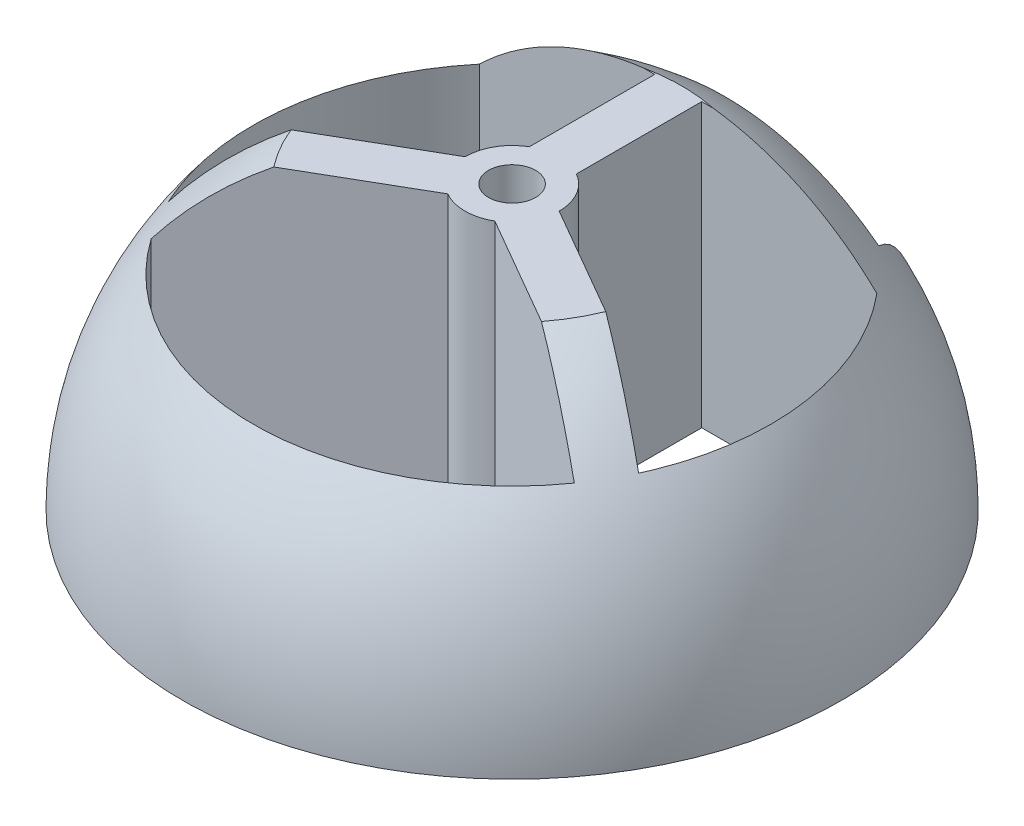
ISO-10303-21;
HEADER;
FILE_DESCRIPTION(('STEP AP214'),'2;1');
FILE_NAME('part.step','',(''),(''),'','','');
FILE_SCHEMA(('AUTOMOTIVE_DESIGN { 1 0 10303 214 1 1 1 1 }'));
ENDSEC;
DATA;
#1=APPLICATION_CONTEXT('core data for automotive mechanical design processes');
#2=APPLICATION_PROTOCOL_DEFINITION('international standard','automotive_design',2000,#1);
#3=PRODUCT_CONTEXT('',#1,'mechanical');
#4=PRODUCT('Part','Part','',(#3));
#5=PRODUCT_RELATED_PRODUCT_CATEGORY('part','',(#4));
#6=PRODUCT_DEFINITION_FORMATION('','',#4);
#7=PRODUCT_DEFINITION_CONTEXT('part definition',#1,'design');
#8=PRODUCT_DEFINITION('design','',#6,#7);
#9=PRODUCT_DEFINITION_SHAPE('','',#8);
#10=(LENGTH_UNIT() NAMED_UNIT(*) SI_UNIT(.MILLI.,.METRE.));
#11=(NAMED_UNIT(*) PLANE_ANGLE_UNIT() SI_UNIT($,.RADIAN.));
#12=(NAMED_UNIT(*) SI_UNIT($,.STERADIAN.) SOLID_ANGLE_UNIT());
#13=UNCERTAINTY_MEASURE_WITH_UNIT(LENGTH_MEASURE(1.E-05),#10,'distance_accuracy_value','');
#14=(GEOMETRIC_REPRESENTATION_CONTEXT(3) GLOBAL_UNCERTAINTY_ASSIGNED_CONTEXT((#13)) GLOBAL_UNIT_ASSIGNED_CONTEXT((#10,
#11,#12)) REPRESENTATION_CONTEXT('',''));
#15=CARTESIAN_POINT('',(0.,0.,0.));
#16=DIRECTION('',(0.,0.,1.));
#17=DIRECTION('',(1.,0.,0.));
#18=AXIS2_PLACEMENT_3D('',#15,#16,#17);
#19=CARTESIAN_POINT('',(0.,14.,0.));
#20=DIRECTION('',(0.,-1.,0.));
#21=DIRECTION('',(0.,0.,-1.));
#22=AXIS2_PLACEMENT_3D('',#19,#20,#21);
#23=CYLINDRICAL_SURFACE('',#22,11.);
#24=CARTESIAN_POINT('',(0.,8.66025403784439,0.));
#25=DIRECTION('',(0.,-1.,0.));
#26=DIRECTION('',(0.,0.,-1.));
#27=AXIS2_PLACEMENT_3D('',#24,#25,#26);
#28=CIRCLE('',#27,11.);
#29=CARTESIAN_POINT('',(8.98683298050515,8.66025403784439,6.34325097883608));
#30=VERTEX_POINT('',#29);
#31=CARTESIAN_POINT('',(-8.98683298050515,8.66025403784439,6.34325097883608));
#32=VERTEX_POINT('',#31);
#33=EDGE_CURVE('E288',#30,#32,#28,.T.);
#34=ORIENTED_EDGE('',*,*,#33,.F.);
#35=DIRECTION('',(0.,-1.,0.));
#36=VECTOR('',#35,1.);
#37=CARTESIAN_POINT('',(8.98683298050515,14.,6.34325097883608));
#38=LINE('',#37,#36);
#39=CARTESIAN_POINT('',(8.98683298050515,0.,6.34325097883608));
#40=VERTEX_POINT('',#39);
#41=EDGE_CURVE('E11',#30,#40,#38,.T.);
#42=ORIENTED_EDGE('',*,*,#41,.T.);
#43=CARTESIAN_POINT('',(0.,0.,0.));
#44=DIRECTION('',(0.,1.,0.));
#45=DIRECTION('',(0.,0.,1.));
#46=AXIS2_PLACEMENT_3D('',#43,#44,#45);
#47=CIRCLE('',#46,11.);
#48=CARTESIAN_POINT('',(-8.98683298050515,0.,6.34325097883608));
#49=VERTEX_POINT('',#48);
#50=EDGE_CURVE('E281',#49,#40,#47,.T.);
#51=ORIENTED_EDGE('',*,*,#50,.F.);
#52=DIRECTION('',(0.,-1.,0.));
#53=VECTOR('',#52,1.);
#54=CARTESIAN_POINT('',(-8.98683298050515,14.,6.34325097883608));
#55=LINE('',#54,#53);
#56=EDGE_CURVE('E48',#49,#32,#55,.F.);
#57=ORIENTED_EDGE('',*,*,#56,.T.);
#58=EDGE_LOOP('',(#34,#42,#51,#57));
#59=FACE_BOUND('',#58,.T.);
#60=ADVANCED_FACE('F39',(#59),#23,.F.);
#61=CARTESIAN_POINT('',(-8.4384304253092,0.,-7.05640786499874));
#62=VERTEX_POINT('',#61);
#63=CARTESIAN_POINT('',(-9.98683298050515,0.,4.6112001712672));
#64=VERTEX_POINT('',#63);
#65=EDGE_CURVE('E282',#62,#64,#47,.T.);
#66=ORIENTED_EDGE('',*,*,#65,.F.);
#67=DIRECTION('',(0.,-1.,0.));
#68=VECTOR('',#67,1.);
#69=CARTESIAN_POINT('',(-8.4384304253092,15.5116701241246,-7.05640786499874));
#70=LINE('',#69,#68);
#71=CARTESIAN_POINT('',(-8.4384304253092,8.66025403784439,-7.05640786499874));
#72=VERTEX_POINT('',#71);
#73=EDGE_CURVE('E241',#72,#62,#70,.T.);
#74=ORIENTED_EDGE('',*,*,#73,.F.);
#75=CARTESIAN_POINT('',(-9.98683298050515,8.66025403784439,4.6112001712672));
#76=VERTEX_POINT('',#75);
#77=EDGE_CURVE('E286',#76,#72,#28,.T.);
#78=ORIENTED_EDGE('',*,*,#77,.F.);
#79=DIRECTION('',(0.,-1.,0.));
#80=VECTOR('',#79,1.);
#81=CARTESIAN_POINT('',(-9.98683298050515,14.,4.6112001712672));
#82=LINE('',#81,#80);
#83=EDGE_CURVE('E195',#76,#64,#82,.T.);
#84=ORIENTED_EDGE('',*,*,#83,.T.);
#85=EDGE_LOOP('',(#66,#74,#78,#84));
#86=FACE_BOUND('',#85,.T.);
#87=ADVANCED_FACE('F375',(#86),#23,.F.);
#88=CARTESIAN_POINT('',(8.4384304253092,8.66025403784439,-7.05640786499874));
#89=VERTEX_POINT('',#88);
#90=CARTESIAN_POINT('',(9.98683298050515,8.66025403784439,4.6112001712672));
#91=VERTEX_POINT('',#90);
#92=EDGE_CURVE('E285',#89,#91,#28,.T.);
#93=ORIENTED_EDGE('',*,*,#92,.F.);
#94=DIRECTION('',(0.,-1.,0.));
#95=VECTOR('',#94,1.);
#96=CARTESIAN_POINT('',(8.4384304253092,15.5116701241246,-7.05640786499874));
#97=LINE('',#96,#95);
#98=CARTESIAN_POINT('',(8.4384304253092,0.,-7.05640786499874));
#99=VERTEX_POINT('',#98);
#100=EDGE_CURVE('E243',#89,#99,#97,.T.);
#101=ORIENTED_EDGE('',*,*,#100,.T.);
#102=CARTESIAN_POINT('',(9.98683298050515,0.,4.6112001712672));
#103=VERTEX_POINT('',#102);
#104=EDGE_CURVE('E278',#103,#99,#47,.T.);
#105=ORIENTED_EDGE('',*,*,#104,.F.);
#106=DIRECTION('',(0.,-1.,0.));
#107=VECTOR('',#106,1.);
#108=CARTESIAN_POINT('',(9.98683298050515,14.,4.6112001712672));
#109=LINE('',#108,#107);
#110=EDGE_CURVE('E290',#103,#91,#109,.F.);
#111=ORIENTED_EDGE('',*,*,#110,.T.);
#112=EDGE_LOOP('',(#93,#101,#105,#111));
#113=FACE_BOUND('',#112,.T.);
#114=ADVANCED_FACE('F312',(#113),#23,.F.);
#115=CARTESIAN_POINT('',(0.,0.,0.));
#116=DIRECTION('',(0.,-1.,0.));
#117=DIRECTION('',(1.,0.,0.));
#118=AXIS2_PLACEMENT_3D('',#115,#116,#117);
#119=SPHERICAL_SURFACE('',#118,14.);
#120=CARTESIAN_POINT('',(0.,12.,0.));
#121=DIRECTION('',(0.,-1.,0.));
#122=DIRECTION('',(0.,0.,-1.));
#123=AXIS2_PLACEMENT_3D('',#120,#121,#122);
#124=CIRCLE('',#123,7.21110255092806);
#125=CARTESIAN_POINT('',(-6.68465843842657,12.,2.70468881048702));
#126=VERTEX_POINT('',#125);
#127=CARTESIAN_POINT('',(-5.68465843842657,12.,4.4367396180559));
#128=VERTEX_POINT('',#127);
#129=EDGE_CURVE('E179',#126,#128,#124,.F.);
#130=ORIENTED_EDGE('',*,*,#129,.F.);
#131=CARTESIAN_POINT('',(-0.499999999999996,0.,-0.866025403784437));
#132=DIRECTION('',(0.499999999999998,0.,0.86602540378444));
#133=DIRECTION('',(0.86602540378444,0.,-0.499999999999998));
#134=AXIS2_PLACEMENT_3D('',#131,#132,#133);
#135=CIRCLE('',#134,13.9642400437689);
#136=EDGE_CURVE('E63',#126,#76,#135,.T.);
#137=ORIENTED_EDGE('',*,*,#136,.T.);
#138=ORIENTED_EDGE('',*,*,#77,.T.);
#139=CARTESIAN_POINT('',(0.,0.,-7.05640786499874));
#140=DIRECTION('',(0.,0.,-1.));
#141=DIRECTION('',(-1.,0.,0.));
#142=AXIS2_PLACEMENT_3D('',#139,#140,#141);
#143=CIRCLE('',#142,12.09161312823);
#144=CARTESIAN_POINT('',(-1.48563388584979,12.,-7.05640786499874));
#145=VERTEX_POINT('',#144);
#146=EDGE_CURVE('E345',#72,#145,#143,.T.);
#147=ORIENTED_EDGE('',*,*,#146,.T.);
#148=CARTESIAN_POINT('',(1.48563388584979,12.,-7.05640786499874));
#149=VERTEX_POINT('',#148);
#150=EDGE_CURVE('E191',#149,#145,#124,.F.);
#151=ORIENTED_EDGE('',*,*,#150,.F.);
#152=CARTESIAN_POINT('',(0.,0.,-7.05640786499874));
#153=DIRECTION('',(0.,0.,-1.));
#154=DIRECTION('',(-1.,0.,0.));
#155=AXIS2_PLACEMENT_3D('',#152,#153,#154);
#156=CIRCLE('',#155,12.09161312823);
#157=EDGE_CURVE('E309',#149,#89,#156,.T.);
#158=ORIENTED_EDGE('',*,*,#157,.T.);
#159=ORIENTED_EDGE('',*,*,#92,.T.);
#160=CARTESIAN_POINT('',(0.499999999999998,0.,-0.866025403784439));
#161=DIRECTION('',(-0.499999999999998,0.,0.86602540378444));
#162=DIRECTION('',(0.86602540378444,0.,0.499999999999998));
#163=AXIS2_PLACEMENT_3D('',#160,#161,#162);
#164=CIRCLE('',#163,13.9642400437689);
#165=CARTESIAN_POINT('',(6.68465843842657,12.,2.70468881048702));
#166=VERTEX_POINT('',#165);
#167=EDGE_CURVE('E306',#91,#166,#164,.T.);
#168=ORIENTED_EDGE('',*,*,#167,.T.);
#169=CARTESIAN_POINT('',(5.68465843842657,12.,4.43673961805589));
#170=VERTEX_POINT('',#169);
#171=EDGE_CURVE('E192',#170,#166,#124,.F.);
#172=ORIENTED_EDGE('',*,*,#171,.F.);
#173=CARTESIAN_POINT('',(-0.499999999999998,0.,0.866025403784439));
#174=DIRECTION('',(0.499999999999998,0.,-0.86602540378444));
#175=DIRECTION('',(-0.86602540378444,0.,-0.499999999999998));
#176=AXIS2_PLACEMENT_3D('',#173,#174,#175);
#177=CIRCLE('',#176,13.9642400437689);
#178=EDGE_CURVE('E202',#170,#30,#177,.T.);
#179=ORIENTED_EDGE('',*,*,#178,.T.);
#180=ORIENTED_EDGE('',*,*,#33,.T.);
#181=CARTESIAN_POINT('',(0.5,0.,0.866025403784444));
#182=DIRECTION('',(-0.499999999999998,0.,-0.86602540378444));
#183=DIRECTION('',(-0.86602540378444,0.,0.499999999999998));
#184=AXIS2_PLACEMENT_3D('',#181,#182,#183);
#185=CIRCLE('',#184,13.9642400437689);
#186=EDGE_CURVE('E188',#32,#128,#185,.T.);
#187=ORIENTED_EDGE('',*,*,#186,.T.);
#188=EDGE_LOOP('',(#130,#137,#138,#147,#151,#158,#159,#168,#172,#179,#180,#187));
#189=FACE_BOUND('',#188,.T.);
#190=CARTESIAN_POINT('',(0.,0.,-9.05640786499874));
#191=DIRECTION('',(0.,0.,-1.));
#192=DIRECTION('',(-1.,0.,0.));
#193=AXIS2_PLACEMENT_3D('',#190,#191,#192);
#194=CIRCLE('',#193,10.6762107783047);
#195=CARTESIAN_POINT('',(6.5172471736668,8.45617915255591,-9.05640786499874));
#196=VERTEX_POINT('',#195);
#197=CARTESIAN_POINT('',(-6.5172471736668,8.45617915255591,-9.05640786499874));
#198=VERTEX_POINT('',#197);
#199=EDGE_CURVE('E270',#196,#198,#194,.F.);
#200=ORIENTED_EDGE('',*,*,#199,.T.);
#201=CARTESIAN_POINT('',(-8.80947501931114,0.,-5.08615277381862));
#202=DIRECTION('',(0.866025403784437,0.,0.500000000000004));
#203=DIRECTION('',(0.500000000000004,0.,-0.866025403784437));
#204=AXIS2_PLACEMENT_3D('',#201,#202,#203);
#205=CIRCLE('',#204,9.61895003862221);
#206=CARTESIAN_POINT('',(-4.00000000000001,0.,-13.4164078649987));
#207=VERTEX_POINT('',#206);
#208=EDGE_CURVE('E275',#198,#207,#205,.F.);
#209=ORIENTED_EDGE('',*,*,#208,.T.);
#210=CARTESIAN_POINT('',(0.,0.,0.));
#211=DIRECTION('',(0.,-1.,0.));
#212=DIRECTION('',(1.,0.,0.));
#213=AXIS2_PLACEMENT_3D('',#210,#211,#212);
#214=CIRCLE('',#213,14.);
#215=CARTESIAN_POINT('',(4.,0.,-13.4164078649987));
#216=VERTEX_POINT('',#215);
#217=EDGE_CURVE('E283',#216,#207,#214,.T.);
#218=ORIENTED_EDGE('',*,*,#217,.F.);
#219=CARTESIAN_POINT('',(8.80947501931114,0.,-5.08615277381863));
#220=DIRECTION('',(-0.866025403784436,0.,0.500000000000004));
#221=DIRECTION('',(0.500000000000004,0.,0.866025403784436));
#222=AXIS2_PLACEMENT_3D('',#219,#220,#221);
#223=CIRCLE('',#222,9.61895003862221);
#224=EDGE_CURVE('E272',#216,#196,#223,.F.);
#225=ORIENTED_EDGE('',*,*,#224,.T.);
#226=EDGE_LOOP('',(#200,#209,#218,#225));
#227=FACE_BOUND('',#226,.T.);
#228=ADVANCED_FACE('F185',(#189,#227),#119,.T.);
#229=CARTESIAN_POINT('',(0.,0.,0.));
#230=DIRECTION('',(0.,-1.,0.));
#231=DIRECTION('',(1.,0.,0.));
#232=AXIS2_PLACEMENT_3D('',#229,#230,#231);
#233=PLANE('',#232);
#234=ORIENTED_EDGE('',*,*,#217,.T.);
#235=DIRECTION('',(-0.500000000000004,0.,0.866025403784436));
#236=VECTOR('',#235,1.);
#237=CARTESIAN_POINT('',(-4.,0.,-13.4164078649987));
#238=LINE('',#237,#236);
#239=CARTESIAN_POINT('',(-6.5172471736668,0.,-9.05640786499874));
#240=VERTEX_POINT('',#239);
#241=EDGE_CURVE('E256',#207,#240,#238,.T.);
#242=ORIENTED_EDGE('',*,*,#241,.T.);
#243=DIRECTION('',(1.,0.,0.));
#244=VECTOR('',#243,1.);
#245=CARTESIAN_POINT('',(-6.5172471736668,0.,-9.05640786499874));
#246=LINE('',#245,#244);
#247=CARTESIAN_POINT('',(6.5172471736668,0.,-9.05640786499874));
#248=VERTEX_POINT('',#247);
#249=EDGE_CURVE('E259',#240,#248,#246,.T.);
#250=ORIENTED_EDGE('',*,*,#249,.T.);
#251=DIRECTION('',(-0.500000000000004,0.,-0.866025403784436));
#252=VECTOR('',#251,1.);
#253=CARTESIAN_POINT('',(6.5172471736668,0.,-9.05640786499874));
#254=LINE('',#253,#252);
#255=EDGE_CURVE('E262',#248,#216,#254,.T.);
#256=ORIENTED_EDGE('',*,*,#255,.T.);
#257=EDGE_LOOP('',(#234,#242,#250,#256));
#258=FACE_BOUND('',#257,.T.);
#259=DIRECTION('',(1.,0.,0.));
#260=VECTOR('',#259,1.);
#261=CARTESIAN_POINT('',(-8.4384304253092,0.,-7.05640786499874));
#262=LINE('',#261,#260);
#263=CARTESIAN_POINT('',(-1.,0.,-7.05640786499874));
#264=VERTEX_POINT('',#263);
#265=EDGE_CURVE('E226',#62,#264,#262,.T.);
#266=ORIENTED_EDGE('',*,*,#265,.F.);
#267=ORIENTED_EDGE('',*,*,#65,.T.);
#268=DIRECTION('',(-0.86602540378444,0.,0.499999999999998));
#269=VECTOR('',#268,1.);
#270=CARTESIAN_POINT('',(-12.5933866224478,0.,6.11609461810001));
#271=LINE('',#270,#269);
#272=CARTESIAN_POINT('',(-2.,0.,0.));
#273=VERTEX_POINT('',#272);
#274=EDGE_CURVE('E200',#273,#64,#271,.T.);
#275=ORIENTED_EDGE('',*,*,#274,.F.);
#276=CARTESIAN_POINT('',(0.,0.,0.));
#277=DIRECTION('',(0.,1.,0.));
#278=DIRECTION('',(0.,0.,-1.));
#279=AXIS2_PLACEMENT_3D('',#276,#277,#278);
#280=CIRCLE('',#279,2.);
#281=CARTESIAN_POINT('',(-1.,0.,-1.73205080756888));
#282=VERTEX_POINT('',#281);
#283=EDGE_CURVE('E232',#282,#273,#280,.T.);
#284=ORIENTED_EDGE('',*,*,#283,.F.);
#285=DIRECTION('',(0.,0.,1.));
#286=VECTOR('',#285,1.);
#287=CARTESIAN_POINT('',(-1.,0.,-7.05640786499874));
#288=LINE('',#287,#286);
#289=EDGE_CURVE('E229',#264,#282,#288,.T.);
#290=ORIENTED_EDGE('',*,*,#289,.F.);
#291=EDGE_LOOP('',(#266,#267,#275,#284,#290));
#292=FACE_BOUND('',#291,.T.);
#293=ORIENTED_EDGE('',*,*,#50,.T.);
#294=DIRECTION('',(0.86602540378444,0.,0.499999999999998));
#295=VECTOR('',#294,1.);
#296=CARTESIAN_POINT('',(1.,0.,1.73205080756887));
#297=LINE('',#296,#295);
#298=CARTESIAN_POINT('',(1.,0.,1.73205080756887));
#299=VERTEX_POINT('',#298);
#300=EDGE_CURVE('E213',#299,#40,#297,.T.);
#301=ORIENTED_EDGE('',*,*,#300,.F.);
#302=CARTESIAN_POINT('',(0.,0.,0.));
#303=DIRECTION('',(0.,1.,0.));
#304=DIRECTION('',(0.,0.,-1.));
#305=AXIS2_PLACEMENT_3D('',#302,#303,#304);
#306=CIRCLE('',#305,2.);
#307=CARTESIAN_POINT('',(-1.,0.,1.73205080756888));
#308=VERTEX_POINT('',#307);
#309=EDGE_CURVE('E210',#308,#299,#306,.T.);
#310=ORIENTED_EDGE('',*,*,#309,.F.);
#311=DIRECTION('',(0.86602540378444,0.,-0.499999999999998));
#312=VECTOR('',#311,1.);
#313=CARTESIAN_POINT('',(-11.5933866224478,0.,7.84814542566889));
#314=LINE('',#313,#312);
#315=EDGE_CURVE('E207',#49,#308,#314,.T.);
#316=ORIENTED_EDGE('',*,*,#315,.F.);
#317=EDGE_LOOP('',(#293,#301,#310,#316));
#318=FACE_BOUND('',#317,.T.);
#319=ORIENTED_EDGE('',*,*,#104,.T.);
#320=DIRECTION('',(1.,0.,0.));
#321=VECTOR('',#320,1.);
#322=CARTESIAN_POINT('',(8.4384304253092,0.,-7.05640786499874));
#323=LINE('',#322,#321);
#324=CARTESIAN_POINT('',(1.,0.,-7.05640786499874));
#325=VERTEX_POINT('',#324);
#326=EDGE_CURVE('E224',#325,#99,#323,.T.);
#327=ORIENTED_EDGE('',*,*,#326,.F.);
#328=DIRECTION('',(0.,0.,-1.));
#329=VECTOR('',#328,1.);
#330=CARTESIAN_POINT('',(1.,0.,-7.05640786499874));
#331=LINE('',#330,#329);
#332=CARTESIAN_POINT('',(1.,0.,-1.73205080756888));
#333=VERTEX_POINT('',#332);
#334=EDGE_CURVE('E221',#333,#325,#331,.T.);
#335=ORIENTED_EDGE('',*,*,#334,.F.);
#336=CARTESIAN_POINT('',(0.,0.,0.));
#337=DIRECTION('',(0.,1.,0.));
#338=DIRECTION('',(0.,0.,-1.));
#339=AXIS2_PLACEMENT_3D('',#336,#337,#338);
#340=CIRCLE('',#339,2.);
#341=CARTESIAN_POINT('',(2.,0.,0.));
#342=VERTEX_POINT('',#341);
#343=EDGE_CURVE('E218',#342,#333,#340,.T.);
#344=ORIENTED_EDGE('',*,*,#343,.F.);
#345=DIRECTION('',(-0.86602540378444,0.,-0.499999999999998));
#346=VECTOR('',#345,1.);
#347=CARTESIAN_POINT('',(12.5933866224478,0.,6.11609461810001));
#348=LINE('',#347,#346);
#349=EDGE_CURVE('E215',#103,#342,#348,.T.);
#350=ORIENTED_EDGE('',*,*,#349,.F.);
#351=EDGE_LOOP('',(#319,#327,#335,#344,#350));
#352=FACE_BOUND('',#351,.T.);
#353=CARTESIAN_POINT('',(0.,0.,0.));
#354=DIRECTION('',(0.,1.,0.));
#355=DIRECTION('',(0.,0.,1.));
#356=AXIS2_PLACEMENT_3D('',#353,#354,#355);
#357=CIRCLE('',#356,1.);
#358=CARTESIAN_POINT('',(0.,0.,1.));
#359=VERTEX_POINT('',#358);
#360=EDGE_CURVE('E197',#359,#359,#357,.T.);
#361=ORIENTED_EDGE('',*,*,#360,.T.);
#362=EDGE_LOOP('',(#361));
#363=FACE_BOUND('',#362,.T.);
#364=ADVANCED_FACE('F41',(#258,#292,#318,#352,#363),#233,.T.);
#365=CARTESIAN_POINT('',(-4.,8.66025403784439,-13.4164078649987));
#366=DIRECTION('',(0.866025403784437,0.,0.500000000000004));
#367=DIRECTION('',(0.500000000000004,0.,-0.866025403784437));
#368=AXIS2_PLACEMENT_3D('',#365,#366,#367);
#369=PLANE('',#368);
#370=DIRECTION('',(0.,-1.,0.));
#371=VECTOR('',#370,1.);
#372=CARTESIAN_POINT('',(-6.5172471736668,8.66025403784439,-9.05640786499874));
#373=LINE('',#372,#371);
#374=EDGE_CURVE('E267',#198,#240,#373,.T.);
#375=ORIENTED_EDGE('',*,*,#374,.T.);
#376=ORIENTED_EDGE('',*,*,#241,.F.);
#377=ORIENTED_EDGE('',*,*,#208,.F.);
#378=EDGE_LOOP('',(#375,#376,#377));
#379=FACE_BOUND('',#378,.T.);
#380=ADVANCED_FACE('F407',(#379),#369,.T.);
#381=CARTESIAN_POINT('',(-6.5172471736668,8.66025403784439,-9.05640786499874));
#382=DIRECTION('',(0.,0.,-1.));
#383=DIRECTION('',(-1.,0.,0.));
#384=AXIS2_PLACEMENT_3D('',#381,#382,#383);
#385=PLANE('',#384);
#386=DIRECTION('',(0.,-1.,0.));
#387=VECTOR('',#386,1.);
#388=CARTESIAN_POINT('',(6.5172471736668,8.66025403784439,-9.05640786499874));
#389=LINE('',#388,#387);
#390=EDGE_CURVE('E265',#196,#248,#389,.T.);
#391=ORIENTED_EDGE('',*,*,#390,.T.);
#392=ORIENTED_EDGE('',*,*,#249,.F.);
#393=ORIENTED_EDGE('',*,*,#374,.F.);
#394=ORIENTED_EDGE('',*,*,#199,.F.);
#395=EDGE_LOOP('',(#391,#392,#393,#394));
#396=FACE_BOUND('',#395,.T.);
#397=ADVANCED_FACE('F412',(#396),#385,.T.);
#398=CARTESIAN_POINT('',(6.5172471736668,8.66025403784439,-9.05640786499874));
#399=DIRECTION('',(-0.866025403784436,0.,0.500000000000004));
#400=DIRECTION('',(0.500000000000004,0.,0.866025403784436));
#401=AXIS2_PLACEMENT_3D('',#398,#399,#400);
#402=PLANE('',#401);
#403=ORIENTED_EDGE('',*,*,#255,.F.);
#404=ORIENTED_EDGE('',*,*,#390,.F.);
#405=ORIENTED_EDGE('',*,*,#224,.F.);
#406=EDGE_LOOP('',(#403,#404,#405));
#407=FACE_BOUND('',#406,.T.);
#408=ADVANCED_FACE('F422',(#407),#402,.T.);
#409=CARTESIAN_POINT('',(1.,15.5116701241246,1.73205080756887));
#410=DIRECTION('',(0.499999999999998,0.,-0.86602540378444));
#411=DIRECTION('',(-0.86602540378444,0.,-0.499999999999998));
#412=AXIS2_PLACEMENT_3D('',#409,#410,#411);
#413=PLANE('',#412);
#414=ORIENTED_EDGE('',*,*,#178,.F.);
#415=DIRECTION('',(-0.86602540378444,0.,-0.499999999999998));
#416=VECTOR('',#415,1.);
#417=CARTESIAN_POINT('',(1.,12.,1.73205080756887));
#418=LINE('',#417,#416);
#419=CARTESIAN_POINT('',(1.,12.,1.73205080756887));
#420=VERTEX_POINT('',#419);
#421=EDGE_CURVE('E333',#170,#420,#418,.T.);
#422=ORIENTED_EDGE('',*,*,#421,.T.);
#423=DIRECTION('',(0.,-1.,0.));
#424=VECTOR('',#423,1.);
#425=CARTESIAN_POINT('',(1.,15.5116701241246,1.73205080756887));
#426=LINE('',#425,#424);
#427=EDGE_CURVE('E252',#420,#299,#426,.T.);
#428=ORIENTED_EDGE('',*,*,#427,.T.);
#429=ORIENTED_EDGE('',*,*,#300,.T.);
#430=ORIENTED_EDGE('',*,*,#41,.F.);
#431=EDGE_LOOP('',(#414,#422,#428,#429,#430));
#432=FACE_BOUND('',#431,.T.);
#433=ADVANCED_FACE('F361',(#432),#413,.F.);
#434=CARTESIAN_POINT('',(0.,15.5116701241246,0.));
#435=DIRECTION('',(0.,-1.,0.));
#436=DIRECTION('',(0.,0.,-1.));
#437=AXIS2_PLACEMENT_3D('',#434,#435,#436);
#438=CYLINDRICAL_SURFACE('',#437,2.);
#439=ORIENTED_EDGE('',*,*,#427,.F.);
#440=CARTESIAN_POINT('',(0.,12.,0.));
#441=DIRECTION('',(0.,-1.,0.));
#442=DIRECTION('',(0.,0.,-1.));
#443=AXIS2_PLACEMENT_3D('',#440,#441,#442);
#444=CIRCLE('',#443,2.);
#445=CARTESIAN_POINT('',(-1.,12.,1.73205080756888));
#446=VERTEX_POINT('',#445);
#447=EDGE_CURVE('E354',#420,#446,#444,.T.);
#448=ORIENTED_EDGE('',*,*,#447,.T.);
#449=DIRECTION('',(0.,-1.,0.));
#450=VECTOR('',#449,1.);
#451=CARTESIAN_POINT('',(-1.,15.5116701241246,1.73205080756888));
#452=LINE('',#451,#450);
#453=EDGE_CURVE('E254',#446,#308,#452,.T.);
#454=ORIENTED_EDGE('',*,*,#453,.T.);
#455=ORIENTED_EDGE('',*,*,#309,.T.);
#456=EDGE_LOOP('',(#439,#448,#454,#455));
#457=FACE_BOUND('',#456,.T.);
#458=ADVANCED_FACE('F362',(#457),#438,.T.);
#459=CARTESIAN_POINT('',(-11.5933866224478,15.5116701241246,7.84814542566889));
#460=DIRECTION('',(-0.499999999999998,0.,-0.86602540378444));
#461=DIRECTION('',(-0.86602540378444,0.,0.499999999999998));
#462=AXIS2_PLACEMENT_3D('',#459,#460,#461);
#463=PLANE('',#462);
#464=ORIENTED_EDGE('',*,*,#453,.F.);
#465=DIRECTION('',(-0.86602540378444,0.,0.499999999999998));
#466=VECTOR('',#465,1.);
#467=CARTESIAN_POINT('',(-11.5933866224478,12.,7.84814542566889));
#468=LINE('',#467,#466);
#469=EDGE_CURVE('E353',#446,#128,#468,.T.);
#470=ORIENTED_EDGE('',*,*,#469,.T.);
#471=ORIENTED_EDGE('',*,*,#186,.F.);
#472=ORIENTED_EDGE('',*,*,#56,.F.);
#473=ORIENTED_EDGE('',*,*,#315,.T.);
#474=EDGE_LOOP('',(#464,#470,#471,#472,#473));
#475=FACE_BOUND('',#474,.T.);
#476=ADVANCED_FACE('F385',(#475),#463,.F.);
#477=CARTESIAN_POINT('',(0.,15.5116701241246,0.));
#478=DIRECTION('',(0.,-1.,0.));
#479=DIRECTION('',(0.,0.,-1.));
#480=AXIS2_PLACEMENT_3D('',#477,#478,#479);
#481=CYLINDRICAL_SURFACE('',#480,2.);
#482=DIRECTION('',(0.,-1.,0.));
#483=VECTOR('',#482,1.);
#484=CARTESIAN_POINT('',(-2.,15.5116701241246,0.));
#485=LINE('',#484,#483);
#486=CARTESIAN_POINT('',(-2.,12.,0.));
#487=VERTEX_POINT('',#486);
#488=EDGE_CURVE('E235',#487,#273,#485,.T.);
#489=ORIENTED_EDGE('',*,*,#488,.F.);
#490=CARTESIAN_POINT('',(0.,12.,0.));
#491=DIRECTION('',(0.,-1.,0.));
#492=DIRECTION('',(0.,0.,-1.));
#493=AXIS2_PLACEMENT_3D('',#490,#491,#492);
#494=CIRCLE('',#493,2.);
#495=CARTESIAN_POINT('',(-1.,12.,-1.73205080756888));
#496=VERTEX_POINT('',#495);
#497=EDGE_CURVE('E55',#487,#496,#494,.T.);
#498=ORIENTED_EDGE('',*,*,#497,.T.);
#499=DIRECTION('',(0.,-1.,0.));
#500=VECTOR('',#499,1.);
#501=CARTESIAN_POINT('',(-1.,15.5116701241246,-1.73205080756888));
#502=LINE('',#501,#500);
#503=EDGE_CURVE('E237',#496,#282,#502,.T.);
#504=ORIENTED_EDGE('',*,*,#503,.T.);
#505=ORIENTED_EDGE('',*,*,#283,.T.);
#506=EDGE_LOOP('',(#489,#498,#504,#505));
#507=FACE_BOUND('',#506,.T.);
#508=ADVANCED_FACE('F383',(#507),#481,.T.);
#509=CARTESIAN_POINT('',(-1.,15.5116701241246,-7.05640786499874));
#510=DIRECTION('',(1.,0.,0.));
#511=DIRECTION('',(0.,0.,-1.));
#512=AXIS2_PLACEMENT_3D('',#509,#510,#511);
#513=PLANE('',#512);
#514=ORIENTED_EDGE('',*,*,#503,.F.);
#515=DIRECTION('',(0.,0.,-1.));
#516=VECTOR('',#515,1.);
#517=CARTESIAN_POINT('',(-1.,12.,-7.05640786499874));
#518=LINE('',#517,#516);
#519=CARTESIAN_POINT('',(-1.,12.,-7.05640786499874));
#520=VERTEX_POINT('',#519);
#521=EDGE_CURVE('E189',#496,#520,#518,.T.);
#522=ORIENTED_EDGE('',*,*,#521,.T.);
#523=DIRECTION('',(0.,-1.,0.));
#524=VECTOR('',#523,1.);
#525=CARTESIAN_POINT('',(-1.,15.5116701241246,-7.05640786499874));
#526=LINE('',#525,#524);
#527=EDGE_CURVE('E239',#520,#264,#526,.T.);
#528=ORIENTED_EDGE('',*,*,#527,.T.);
#529=ORIENTED_EDGE('',*,*,#289,.T.);
#530=EDGE_LOOP('',(#514,#522,#528,#529));
#531=FACE_BOUND('',#530,.T.);
#532=ADVANCED_FACE('F381',(#531),#513,.F.);
#533=CARTESIAN_POINT('',(-8.4384304253092,15.5116701241246,-7.05640786499874));
#534=DIRECTION('',(0.,0.,-1.));
#535=DIRECTION('',(-1.,0.,0.));
#536=AXIS2_PLACEMENT_3D('',#533,#534,#535);
#537=PLANE('',#536);
#538=ORIENTED_EDGE('',*,*,#527,.F.);
#539=DIRECTION('',(-1.,0.,0.));
#540=VECTOR('',#539,1.);
#541=CARTESIAN_POINT('',(-8.4384304253092,12.,-7.05640786499874));
#542=LINE('',#541,#540);
#543=EDGE_CURVE('E342',#520,#145,#542,.T.);
#544=ORIENTED_EDGE('',*,*,#543,.T.);
#545=ORIENTED_EDGE('',*,*,#146,.F.);
#546=ORIENTED_EDGE('',*,*,#73,.T.);
#547=ORIENTED_EDGE('',*,*,#265,.T.);
#548=EDGE_LOOP('',(#538,#544,#545,#546,#547));
#549=FACE_BOUND('',#548,.T.);
#550=ADVANCED_FACE('F378',(#549),#537,.F.);
#551=CARTESIAN_POINT('',(8.4384304253092,15.5116701241246,-7.05640786499874));
#552=DIRECTION('',(0.,0.,-1.));
#553=DIRECTION('',(-1.,0.,0.));
#554=AXIS2_PLACEMENT_3D('',#551,#552,#553);
#555=PLANE('',#554);
#556=ORIENTED_EDGE('',*,*,#157,.F.);
#557=DIRECTION('',(-1.,0.,0.));
#558=VECTOR('',#557,1.);
#559=CARTESIAN_POINT('',(8.4384304253092,12.,-7.05640786499874));
#560=LINE('',#559,#558);
#561=CARTESIAN_POINT('',(1.,12.,-7.05640786499874));
#562=VERTEX_POINT('',#561);
#563=EDGE_CURVE('E339',#149,#562,#560,.T.);
#564=ORIENTED_EDGE('',*,*,#563,.T.);
#565=DIRECTION('',(0.,-1.,0.));
#566=VECTOR('',#565,1.);
#567=CARTESIAN_POINT('',(1.,15.5116701241246,-7.05640786499874));
#568=LINE('',#567,#566);
#569=EDGE_CURVE('E246',#562,#325,#568,.T.);
#570=ORIENTED_EDGE('',*,*,#569,.T.);
#571=ORIENTED_EDGE('',*,*,#326,.T.);
#572=ORIENTED_EDGE('',*,*,#100,.F.);
#573=EDGE_LOOP('',(#556,#564,#570,#571,#572));
#574=FACE_BOUND('',#573,.T.);
#575=ADVANCED_FACE('F444',(#574),#555,.F.);
#576=CARTESIAN_POINT('',(1.,15.5116701241246,-7.05640786499874));
#577=DIRECTION('',(-1.,0.,0.));
#578=DIRECTION('',(0.,0.,1.));
#579=AXIS2_PLACEMENT_3D('',#576,#577,#578);
#580=PLANE('',#579);
#581=ORIENTED_EDGE('',*,*,#569,.F.);
#582=DIRECTION('',(0.,0.,1.));
#583=VECTOR('',#582,1.);
#584=CARTESIAN_POINT('',(1.,12.,-7.05640786499874));
#585=LINE('',#584,#583);
#586=CARTESIAN_POINT('',(1.,12.,-1.73205080756888));
#587=VERTEX_POINT('',#586);
#588=EDGE_CURVE('E331',#562,#587,#585,.T.);
#589=ORIENTED_EDGE('',*,*,#588,.T.);
#590=DIRECTION('',(0.,-1.,0.));
#591=VECTOR('',#590,1.);
#592=CARTESIAN_POINT('',(1.,15.5116701241246,-1.73205080756888));
#593=LINE('',#592,#591);
#594=EDGE_CURVE('E248',#587,#333,#593,.T.);
#595=ORIENTED_EDGE('',*,*,#594,.T.);
#596=ORIENTED_EDGE('',*,*,#334,.T.);
#597=EDGE_LOOP('',(#581,#589,#595,#596));
#598=FACE_BOUND('',#597,.T.);
#599=ADVANCED_FACE('F441',(#598),#580,.F.);
#600=CARTESIAN_POINT('',(0.,15.5116701241246,0.));
#601=DIRECTION('',(0.,-1.,0.));
#602=DIRECTION('',(0.,0.,-1.));
#603=AXIS2_PLACEMENT_3D('',#600,#601,#602);
#604=CYLINDRICAL_SURFACE('',#603,2.);
#605=ORIENTED_EDGE('',*,*,#594,.F.);
#606=CARTESIAN_POINT('',(0.,12.,0.));
#607=DIRECTION('',(0.,-1.,0.));
#608=DIRECTION('',(0.,0.,-1.));
#609=AXIS2_PLACEMENT_3D('',#606,#607,#608);
#610=CIRCLE('',#609,2.);
#611=CARTESIAN_POINT('',(2.,12.,0.));
#612=VERTEX_POINT('',#611);
#613=EDGE_CURVE('E328',#587,#612,#610,.T.);
#614=ORIENTED_EDGE('',*,*,#613,.T.);
#615=DIRECTION('',(0.,-1.,0.));
#616=VECTOR('',#615,1.);
#617=CARTESIAN_POINT('',(2.,15.5116701241246,0.));
#618=LINE('',#617,#616);
#619=EDGE_CURVE('E250',#612,#342,#618,.T.);
#620=ORIENTED_EDGE('',*,*,#619,.T.);
#621=ORIENTED_EDGE('',*,*,#343,.T.);
#622=EDGE_LOOP('',(#605,#614,#620,#621));
#623=FACE_BOUND('',#622,.T.);
#624=ADVANCED_FACE('F326',(#623),#604,.T.);
#625=CARTESIAN_POINT('',(12.5933866224478,15.5116701241246,6.11609461810001));
#626=DIRECTION('',(-0.499999999999998,0.,0.86602540378444));
#627=DIRECTION('',(0.86602540378444,0.,0.499999999999998));
#628=AXIS2_PLACEMENT_3D('',#625,#626,#627);
#629=PLANE('',#628);
#630=ORIENTED_EDGE('',*,*,#619,.F.);
#631=DIRECTION('',(0.86602540378444,0.,0.499999999999998));
#632=VECTOR('',#631,1.);
#633=CARTESIAN_POINT('',(12.5933866224478,12.,6.11609461810001));
#634=LINE('',#633,#632);
#635=EDGE_CURVE('E329',#612,#166,#634,.T.);
#636=ORIENTED_EDGE('',*,*,#635,.T.);
#637=ORIENTED_EDGE('',*,*,#167,.F.);
#638=ORIENTED_EDGE('',*,*,#110,.F.);
#639=ORIENTED_EDGE('',*,*,#349,.T.);
#640=EDGE_LOOP('',(#630,#636,#637,#638,#639));
#641=FACE_BOUND('',#640,.T.);
#642=ADVANCED_FACE('F317',(#641),#629,.F.);
#643=CARTESIAN_POINT('',(-12.5933866224478,15.5116701241246,6.11609461810001));
#644=DIRECTION('',(0.499999999999998,0.,0.86602540378444));
#645=DIRECTION('',(0.86602540378444,0.,-0.499999999999998));
#646=AXIS2_PLACEMENT_3D('',#643,#644,#645);
#647=PLANE('',#646);
#648=ORIENTED_EDGE('',*,*,#136,.F.);
#649=DIRECTION('',(0.86602540378444,0.,-0.499999999999998));
#650=VECTOR('',#649,1.);
#651=CARTESIAN_POINT('',(-12.5933866224478,12.,6.11609461810001));
#652=LINE('',#651,#650);
#653=EDGE_CURVE('E176',#126,#487,#652,.T.);
#654=ORIENTED_EDGE('',*,*,#653,.T.);
#655=ORIENTED_EDGE('',*,*,#488,.T.);
#656=ORIENTED_EDGE('',*,*,#274,.T.);
#657=ORIENTED_EDGE('',*,*,#83,.F.);
#658=EDGE_LOOP('',(#648,#654,#655,#656,#657));
#659=FACE_BOUND('',#658,.T.);
#660=ADVANCED_FACE('F193',(#659),#647,.F.);
#661=CARTESIAN_POINT('',(0.,15.5116701241246,0.));
#662=DIRECTION('',(0.,-1.,0.));
#663=DIRECTION('',(0.,0.,-1.));
#664=AXIS2_PLACEMENT_3D('',#661,#662,#663);
#665=CYLINDRICAL_SURFACE('',#664,1.);
#666=CARTESIAN_POINT('',(0.,12.,0.));
#667=DIRECTION('',(0.,-1.,0.));
#668=DIRECTION('',(0.,0.,-1.));
#669=AXIS2_PLACEMENT_3D('',#666,#667,#668);
#670=CIRCLE('',#669,1.);
#671=CARTESIAN_POINT('',(0.,12.,-1.));
#672=VERTEX_POINT('',#671);
#673=EDGE_CURVE('E43',#672,#672,#670,.T.);
#674=ORIENTED_EDGE('',*,*,#673,.F.);
#675=EDGE_LOOP('',(#674));
#676=FACE_BOUND('',#675,.T.);
#677=ORIENTED_EDGE('',*,*,#360,.F.);
#678=EDGE_LOOP('',(#677));
#679=FACE_BOUND('',#678,.T.);
#680=ADVANCED_FACE('F433',(#676,#679),#665,.F.);
#681=CARTESIAN_POINT('',(-9.97928939747121,12.,-14.));
#682=DIRECTION('',(0.,-1.,0.));
#683=DIRECTION('',(0.,0.,-1.));
#684=AXIS2_PLACEMENT_3D('',#681,#682,#683);
#685=PLANE('',#684);
#686=ORIENTED_EDGE('',*,*,#150,.T.);
#687=ORIENTED_EDGE('',*,*,#543,.F.);
#688=ORIENTED_EDGE('',*,*,#521,.F.);
#689=ORIENTED_EDGE('',*,*,#497,.F.);
#690=ORIENTED_EDGE('',*,*,#653,.F.);
#691=ORIENTED_EDGE('',*,*,#129,.T.);
#692=ORIENTED_EDGE('',*,*,#469,.F.);
#693=ORIENTED_EDGE('',*,*,#447,.F.);
#694=ORIENTED_EDGE('',*,*,#421,.F.);
#695=ORIENTED_EDGE('',*,*,#171,.T.);
#696=ORIENTED_EDGE('',*,*,#635,.F.);
#697=ORIENTED_EDGE('',*,*,#613,.F.);
#698=ORIENTED_EDGE('',*,*,#588,.F.);
#699=ORIENTED_EDGE('',*,*,#563,.F.);
#700=EDGE_LOOP('',(#686,#687,#688,#689,#690,#691,#692,#693,#694,#695,#696,#697,#698,#699));
#701=FACE_BOUND('',#700,.T.);
#702=ORIENTED_EDGE('',*,*,#673,.T.);
#703=EDGE_LOOP('',(#702));
#704=FACE_BOUND('',#703,.T.);
#705=ADVANCED_FACE('F177',(#701,#704),#685,.F.);
#706=CLOSED_SHELL('',(#60,#87,#114,#228,#364,#380,#397,#408,#433,#458,#476,#508,#532,#550,#575,
#599,#624,#642,#660,#680,#705));
#707=MANIFOLD_SOLID_BREP('B2',#706);
#708=ADVANCED_BREP_SHAPE_REPRESENTATION('',(#18,#707),#14);
#709=SHAPE_DEFINITION_REPRESENTATION(#9,#708);
ENDSEC;
END-ISO-10303-21;
